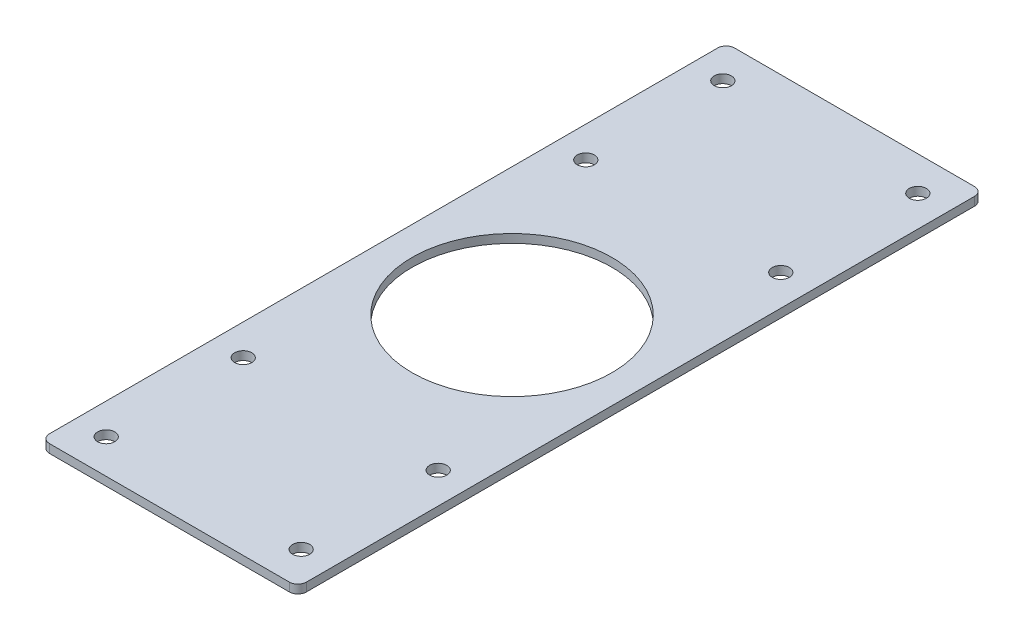
ISO-10303-21;
HEADER;
FILE_DESCRIPTION(('STEP AP214'),'2;1');
FILE_NAME('part.step','',(''),(''),'','','');
FILE_SCHEMA(('AUTOMOTIVE_DESIGN { 1 0 10303 214 1 1 1 1 }'));
ENDSEC;
DATA;
#1=APPLICATION_CONTEXT('core data for automotive mechanical design processes');
#2=APPLICATION_PROTOCOL_DEFINITION('international standard','automotive_design',2000,#1);
#3=PRODUCT_CONTEXT('',#1,'mechanical');
#4=PRODUCT('Part','Part','',(#3));
#5=PRODUCT_RELATED_PRODUCT_CATEGORY('part','',(#4));
#6=PRODUCT_DEFINITION_FORMATION('','',#4);
#7=PRODUCT_DEFINITION_CONTEXT('part definition',#1,'design');
#8=PRODUCT_DEFINITION('design','',#6,#7);
#9=PRODUCT_DEFINITION_SHAPE('','',#8);
#10=(LENGTH_UNIT() NAMED_UNIT(*) SI_UNIT(.MILLI.,.METRE.));
#11=(NAMED_UNIT(*) PLANE_ANGLE_UNIT() SI_UNIT($,.RADIAN.));
#12=(NAMED_UNIT(*) SI_UNIT($,.STERADIAN.) SOLID_ANGLE_UNIT());
#13=UNCERTAINTY_MEASURE_WITH_UNIT(LENGTH_MEASURE(1.E-05),#10,'distance_accuracy_value','');
#14=(GEOMETRIC_REPRESENTATION_CONTEXT(3) GLOBAL_UNCERTAINTY_ASSIGNED_CONTEXT((#13)) GLOBAL_UNIT_ASSIGNED_CONTEXT((#10,
#11,#12)) REPRESENTATION_CONTEXT('',''));
#15=CARTESIAN_POINT('',(0.,0.,0.));
#16=DIRECTION('',(0.,0.,1.));
#17=DIRECTION('',(1.,0.,0.));
#18=AXIS2_PLACEMENT_3D('',#15,#16,#17);
#19=CARTESIAN_POINT('',(0.,3.,0.));
#20=DIRECTION('',(0.,-1.,0.));
#21=DIRECTION('',(0.,0.,-1.));
#22=AXIS2_PLACEMENT_3D('',#19,#20,#21);
#23=PLANE('',#22);
#24=DIRECTION('',(-1.,0.,0.));
#25=VECTOR('',#24,1.);
#26=CARTESIAN_POINT('',(-45.,3.,-120.));
#27=LINE('',#26,#25);
#28=CARTESIAN_POINT('',(42.,3.,-120.));
#29=VERTEX_POINT('',#28);
#30=CARTESIAN_POINT('',(-42.,3.,-120.));
#31=VERTEX_POINT('',#30);
#32=EDGE_CURVE('E169',#29,#31,#27,.T.);
#33=ORIENTED_EDGE('',*,*,#32,.T.);
#34=CARTESIAN_POINT('',(-42.,3.,-117.));
#35=DIRECTION('',(0.,-1.,0.));
#36=DIRECTION('',(0.,0.,-1.));
#37=AXIS2_PLACEMENT_3D('',#34,#35,#36);
#38=CIRCLE('',#37,3.);
#39=CARTESIAN_POINT('',(-45.,3.,-117.));
#40=VERTEX_POINT('',#39);
#41=EDGE_CURVE('E149',#31,#40,#38,.F.);
#42=ORIENTED_EDGE('',*,*,#41,.T.);
#43=DIRECTION('',(0.,0.,1.));
#44=VECTOR('',#43,1.);
#45=CARTESIAN_POINT('',(-45.,3.,120.));
#46=LINE('',#45,#44);
#47=CARTESIAN_POINT('',(-45.,3.,117.));
#48=VERTEX_POINT('',#47);
#49=EDGE_CURVE('E119',#40,#48,#46,.T.);
#50=ORIENTED_EDGE('',*,*,#49,.T.);
#51=CARTESIAN_POINT('',(-42.,3.,117.));
#52=DIRECTION('',(0.,-1.,0.));
#53=DIRECTION('',(0.,0.,-1.));
#54=AXIS2_PLACEMENT_3D('',#51,#52,#53);
#55=CIRCLE('',#54,3.);
#56=CARTESIAN_POINT('',(-42.,3.,120.));
#57=VERTEX_POINT('',#56);
#58=EDGE_CURVE('E55',#48,#57,#55,.F.);
#59=ORIENTED_EDGE('',*,*,#58,.T.);
#60=DIRECTION('',(1.,0.,0.));
#61=VECTOR('',#60,1.);
#62=CARTESIAN_POINT('',(-45.,3.,120.));
#63=LINE('',#62,#61);
#64=CARTESIAN_POINT('',(42.,3.,120.));
#65=VERTEX_POINT('',#64);
#66=EDGE_CURVE('E136',#57,#65,#63,.T.);
#67=ORIENTED_EDGE('',*,*,#66,.T.);
#68=CARTESIAN_POINT('',(42.,3.,117.));
#69=DIRECTION('',(0.,-1.,0.));
#70=DIRECTION('',(0.,0.,-1.));
#71=AXIS2_PLACEMENT_3D('',#68,#69,#70);
#72=CIRCLE('',#71,3.);
#73=CARTESIAN_POINT('',(45.,3.,117.));
#74=VERTEX_POINT('',#73);
#75=EDGE_CURVE('E144',#65,#74,#72,.F.);
#76=ORIENTED_EDGE('',*,*,#75,.T.);
#77=DIRECTION('',(0.,0.,-1.));
#78=VECTOR('',#77,1.);
#79=CARTESIAN_POINT('',(45.,3.,120.));
#80=LINE('',#79,#78);
#81=CARTESIAN_POINT('',(45.,3.,-117.));
#82=VERTEX_POINT('',#81);
#83=EDGE_CURVE('E130',#74,#82,#80,.T.);
#84=ORIENTED_EDGE('',*,*,#83,.T.);
#85=CARTESIAN_POINT('',(42.,3.,-117.));
#86=DIRECTION('',(0.,-1.,0.));
#87=DIRECTION('',(0.,0.,-1.));
#88=AXIS2_PLACEMENT_3D('',#85,#86,#87);
#89=CIRCLE('',#88,3.);
#90=EDGE_CURVE('E147',#82,#29,#89,.F.);
#91=ORIENTED_EDGE('',*,*,#90,.T.);
#92=EDGE_LOOP('',(#33,#42,#50,#59,#67,#76,#84,#91));
#93=FACE_BOUND('',#92,.T.);
#94=CARTESIAN_POINT('',(0.,3.,0.));
#95=DIRECTION('',(0.,1.,0.));
#96=DIRECTION('',(0.,0.,1.));
#97=AXIS2_PLACEMENT_3D('',#94,#95,#96);
#98=CIRCLE('',#97,35.);
#99=CARTESIAN_POINT('',(0.,3.,35.));
#100=VERTEX_POINT('',#99);
#101=EDGE_CURVE('E175',#100,#100,#98,.T.);
#102=ORIENTED_EDGE('',*,*,#101,.F.);
#103=EDGE_LOOP('',(#102));
#104=FACE_BOUND('',#103,.T.);
#105=CARTESIAN_POINT('',(-34.15,3.,-60.));
#106=DIRECTION('',(0.,1.,0.));
#107=DIRECTION('',(0.,0.,1.));
#108=AXIS2_PLACEMENT_3D('',#105,#106,#107);
#109=CIRCLE('',#108,3.);
#110=CARTESIAN_POINT('',(-34.15,3.,-57.));
#111=VERTEX_POINT('',#110);
#112=EDGE_CURVE('E184',#111,#111,#109,.T.);
#113=ORIENTED_EDGE('',*,*,#112,.F.);
#114=EDGE_LOOP('',(#113));
#115=FACE_BOUND('',#114,.T.);
#116=CARTESIAN_POINT('',(34.15,3.,-60.));
#117=DIRECTION('',(0.,1.,0.));
#118=DIRECTION('',(0.,0.,-1.));
#119=AXIS2_PLACEMENT_3D('',#116,#117,#118);
#120=CIRCLE('',#119,3.);
#121=CARTESIAN_POINT('',(34.15,3.,-63.));
#122=VERTEX_POINT('',#121);
#123=EDGE_CURVE('E189',#122,#122,#120,.T.);
#124=ORIENTED_EDGE('',*,*,#123,.F.);
#125=EDGE_LOOP('',(#124));
#126=FACE_BOUND('',#125,.T.);
#127=CARTESIAN_POINT('',(34.15,3.,60.));
#128=DIRECTION('',(0.,1.,0.));
#129=DIRECTION('',(0.,0.,1.));
#130=AXIS2_PLACEMENT_3D('',#127,#128,#129);
#131=CIRCLE('',#130,3.);
#132=CARTESIAN_POINT('',(34.15,3.,63.));
#133=VERTEX_POINT('',#132);
#134=EDGE_CURVE('E195',#133,#133,#131,.T.);
#135=ORIENTED_EDGE('',*,*,#134,.F.);
#136=EDGE_LOOP('',(#135));
#137=FACE_BOUND('',#136,.T.);
#138=CARTESIAN_POINT('',(-34.15,3.,60.));
#139=DIRECTION('',(0.,1.,0.));
#140=DIRECTION('',(0.,0.,-1.));
#141=AXIS2_PLACEMENT_3D('',#138,#139,#140);
#142=CIRCLE('',#141,3.);
#143=CARTESIAN_POINT('',(-34.15,3.,57.));
#144=VERTEX_POINT('',#143);
#145=EDGE_CURVE('E201',#144,#144,#142,.T.);
#146=ORIENTED_EDGE('',*,*,#145,.F.);
#147=EDGE_LOOP('',(#146));
#148=FACE_BOUND('',#147,.T.);
#149=CARTESIAN_POINT('',(-34.1500000000002,3.,-108.));
#150=DIRECTION('',(0.,1.,0.));
#151=DIRECTION('',(0.,0.,1.));
#152=AXIS2_PLACEMENT_3D('',#149,#150,#151);
#153=CIRCLE('',#152,3.);
#154=CARTESIAN_POINT('',(-34.1500000000002,3.,-105.));
#155=VERTEX_POINT('',#154);
#156=EDGE_CURVE('E207',#155,#155,#153,.T.);
#157=ORIENTED_EDGE('',*,*,#156,.F.);
#158=EDGE_LOOP('',(#157));
#159=FACE_BOUND('',#158,.T.);
#160=CARTESIAN_POINT('',(34.1499999999998,3.,-108.));
#161=DIRECTION('',(0.,1.,0.));
#162=DIRECTION('',(0.,0.,-1.));
#163=AXIS2_PLACEMENT_3D('',#160,#161,#162);
#164=CIRCLE('',#163,3.);
#165=CARTESIAN_POINT('',(34.1499999999998,3.,-111.));
#166=VERTEX_POINT('',#165);
#167=EDGE_CURVE('E213',#166,#166,#164,.T.);
#168=ORIENTED_EDGE('',*,*,#167,.F.);
#169=EDGE_LOOP('',(#168));
#170=FACE_BOUND('',#169,.T.);
#171=CARTESIAN_POINT('',(34.1500000000005,3.,108.));
#172=DIRECTION('',(0.,1.,0.));
#173=DIRECTION('',(0.,0.,1.));
#174=AXIS2_PLACEMENT_3D('',#171,#172,#173);
#175=CIRCLE('',#174,3.);
#176=CARTESIAN_POINT('',(34.1500000000005,3.,111.));
#177=VERTEX_POINT('',#176);
#178=EDGE_CURVE('E219',#177,#177,#175,.T.);
#179=ORIENTED_EDGE('',*,*,#178,.F.);
#180=EDGE_LOOP('',(#179));
#181=FACE_BOUND('',#180,.T.);
#182=CARTESIAN_POINT('',(-34.1499999999995,3.,108.));
#183=DIRECTION('',(0.,1.,0.));
#184=DIRECTION('',(0.,0.,-1.));
#185=AXIS2_PLACEMENT_3D('',#182,#183,#184);
#186=CIRCLE('',#185,3.);
#187=CARTESIAN_POINT('',(-34.1499999999995,3.,105.));
#188=VERTEX_POINT('',#187);
#189=EDGE_CURVE('E225',#188,#188,#186,.T.);
#190=ORIENTED_EDGE('',*,*,#189,.F.);
#191=EDGE_LOOP('',(#190));
#192=FACE_BOUND('',#191,.T.);
#193=ADVANCED_FACE('F34',(#93,#104,#115,#126,#137,#148,#159,#170,#181,#192),#23,.F.);
#194=CARTESIAN_POINT('',(0.,0.,0.));
#195=DIRECTION('',(0.,-1.,0.));
#196=DIRECTION('',(0.,0.,-1.));
#197=AXIS2_PLACEMENT_3D('',#194,#195,#196);
#198=PLANE('',#197);
#199=CARTESIAN_POINT('',(34.1500000000005,0.,108.));
#200=DIRECTION('',(0.,1.,0.));
#201=DIRECTION('',(0.,0.,1.));
#202=AXIS2_PLACEMENT_3D('',#199,#200,#201);
#203=CIRCLE('',#202,3.);
#204=CARTESIAN_POINT('',(34.1500000000005,0.,111.));
#205=VERTEX_POINT('',#204);
#206=EDGE_CURVE('E222',#205,#205,#203,.T.);
#207=ORIENTED_EDGE('',*,*,#206,.T.);
#208=EDGE_LOOP('',(#207));
#209=FACE_BOUND('',#208,.T.);
#210=CARTESIAN_POINT('',(-34.1500000000002,0.,-108.));
#211=DIRECTION('',(0.,1.,0.));
#212=DIRECTION('',(0.,0.,1.));
#213=AXIS2_PLACEMENT_3D('',#210,#211,#212);
#214=CIRCLE('',#213,3.);
#215=CARTESIAN_POINT('',(-34.1500000000002,0.,-105.));
#216=VERTEX_POINT('',#215);
#217=EDGE_CURVE('E210',#216,#216,#214,.T.);
#218=ORIENTED_EDGE('',*,*,#217,.T.);
#219=EDGE_LOOP('',(#218));
#220=FACE_BOUND('',#219,.T.);
#221=CARTESIAN_POINT('',(34.15,0.,60.));
#222=DIRECTION('',(0.,1.,0.));
#223=DIRECTION('',(0.,0.,1.));
#224=AXIS2_PLACEMENT_3D('',#221,#222,#223);
#225=CIRCLE('',#224,3.);
#226=CARTESIAN_POINT('',(34.15,0.,63.));
#227=VERTEX_POINT('',#226);
#228=EDGE_CURVE('E198',#227,#227,#225,.T.);
#229=ORIENTED_EDGE('',*,*,#228,.T.);
#230=EDGE_LOOP('',(#229));
#231=FACE_BOUND('',#230,.T.);
#232=CARTESIAN_POINT('',(-34.15,0.,-60.));
#233=DIRECTION('',(0.,1.,0.));
#234=DIRECTION('',(0.,0.,1.));
#235=AXIS2_PLACEMENT_3D('',#232,#233,#234);
#236=CIRCLE('',#235,3.);
#237=CARTESIAN_POINT('',(-34.15,0.,-57.));
#238=VERTEX_POINT('',#237);
#239=EDGE_CURVE('E186',#238,#238,#236,.T.);
#240=ORIENTED_EDGE('',*,*,#239,.T.);
#241=EDGE_LOOP('',(#240));
#242=FACE_BOUND('',#241,.T.);
#243=DIRECTION('',(0.,0.,1.));
#244=VECTOR('',#243,1.);
#245=CARTESIAN_POINT('',(-45.,0.,120.));
#246=LINE('',#245,#244);
#247=CARTESIAN_POINT('',(-45.,0.,-117.));
#248=VERTEX_POINT('',#247);
#249=CARTESIAN_POINT('',(-45.,0.,117.));
#250=VERTEX_POINT('',#249);
#251=EDGE_CURVE('E117',#248,#250,#246,.T.);
#252=ORIENTED_EDGE('',*,*,#251,.F.);
#253=CARTESIAN_POINT('',(-42.,0.,-117.));
#254=DIRECTION('',(0.,-1.,0.));
#255=DIRECTION('',(0.,0.,-1.));
#256=AXIS2_PLACEMENT_3D('',#253,#254,#255);
#257=CIRCLE('',#256,3.);
#258=CARTESIAN_POINT('',(-42.,0.,-120.));
#259=VERTEX_POINT('',#258);
#260=EDGE_CURVE('E100',#248,#259,#257,.T.);
#261=ORIENTED_EDGE('',*,*,#260,.T.);
#262=DIRECTION('',(-1.,0.,0.));
#263=VECTOR('',#262,1.);
#264=CARTESIAN_POINT('',(-45.,0.,-120.));
#265=LINE('',#264,#263);
#266=CARTESIAN_POINT('',(42.,0.,-120.));
#267=VERTEX_POINT('',#266);
#268=EDGE_CURVE('E128',#267,#259,#265,.T.);
#269=ORIENTED_EDGE('',*,*,#268,.F.);
#270=CARTESIAN_POINT('',(42.,0.,-117.));
#271=DIRECTION('',(0.,-1.,0.));
#272=DIRECTION('',(0.,0.,-1.));
#273=AXIS2_PLACEMENT_3D('',#270,#271,#272);
#274=CIRCLE('',#273,3.);
#275=CARTESIAN_POINT('',(45.,0.,-117.));
#276=VERTEX_POINT('',#275);
#277=EDGE_CURVE('E111',#267,#276,#274,.T.);
#278=ORIENTED_EDGE('',*,*,#277,.T.);
#279=DIRECTION('',(0.,0.,-1.));
#280=VECTOR('',#279,1.);
#281=CARTESIAN_POINT('',(45.,0.,120.));
#282=LINE('',#281,#280);
#283=CARTESIAN_POINT('',(45.,0.,117.));
#284=VERTEX_POINT('',#283);
#285=EDGE_CURVE('E132',#284,#276,#282,.T.);
#286=ORIENTED_EDGE('',*,*,#285,.F.);
#287=CARTESIAN_POINT('',(42.,0.,117.));
#288=DIRECTION('',(0.,-1.,0.));
#289=DIRECTION('',(0.,0.,-1.));
#290=AXIS2_PLACEMENT_3D('',#287,#288,#289);
#291=CIRCLE('',#290,3.);
#292=CARTESIAN_POINT('',(42.,0.,120.));
#293=VERTEX_POINT('',#292);
#294=EDGE_CURVE('E120',#284,#293,#291,.T.);
#295=ORIENTED_EDGE('',*,*,#294,.T.);
#296=DIRECTION('',(1.,0.,0.));
#297=VECTOR('',#296,1.);
#298=CARTESIAN_POINT('',(-45.,0.,120.));
#299=LINE('',#298,#297);
#300=CARTESIAN_POINT('',(-42.,0.,120.));
#301=VERTEX_POINT('',#300);
#302=EDGE_CURVE('E127',#301,#293,#299,.T.);
#303=ORIENTED_EDGE('',*,*,#302,.F.);
#304=CARTESIAN_POINT('',(-42.,0.,117.));
#305=DIRECTION('',(0.,-1.,0.));
#306=DIRECTION('',(0.,0.,-1.));
#307=AXIS2_PLACEMENT_3D('',#304,#305,#306);
#308=CIRCLE('',#307,3.);
#309=EDGE_CURVE('E126',#301,#250,#308,.T.);
#310=ORIENTED_EDGE('',*,*,#309,.T.);
#311=EDGE_LOOP('',(#252,#261,#269,#278,#286,#295,#303,#310));
#312=FACE_BOUND('',#311,.T.);
#313=CARTESIAN_POINT('',(0.,0.,0.));
#314=DIRECTION('',(0.,1.,0.));
#315=DIRECTION('',(0.,0.,1.));
#316=AXIS2_PLACEMENT_3D('',#313,#314,#315);
#317=CIRCLE('',#316,35.);
#318=CARTESIAN_POINT('',(0.,0.,35.));
#319=VERTEX_POINT('',#318);
#320=EDGE_CURVE('E177',#319,#319,#317,.T.);
#321=ORIENTED_EDGE('',*,*,#320,.T.);
#322=EDGE_LOOP('',(#321));
#323=FACE_BOUND('',#322,.T.);
#324=CARTESIAN_POINT('',(34.15,0.,-60.));
#325=DIRECTION('',(0.,1.,0.));
#326=DIRECTION('',(0.,0.,-1.));
#327=AXIS2_PLACEMENT_3D('',#324,#325,#326);
#328=CIRCLE('',#327,3.);
#329=CARTESIAN_POINT('',(34.15,0.,-63.));
#330=VERTEX_POINT('',#329);
#331=EDGE_CURVE('E192',#330,#330,#328,.T.);
#332=ORIENTED_EDGE('',*,*,#331,.T.);
#333=EDGE_LOOP('',(#332));
#334=FACE_BOUND('',#333,.T.);
#335=CARTESIAN_POINT('',(-34.15,0.,60.));
#336=DIRECTION('',(0.,1.,0.));
#337=DIRECTION('',(0.,0.,-1.));
#338=AXIS2_PLACEMENT_3D('',#335,#336,#337);
#339=CIRCLE('',#338,3.);
#340=CARTESIAN_POINT('',(-34.15,0.,57.));
#341=VERTEX_POINT('',#340);
#342=EDGE_CURVE('E204',#341,#341,#339,.T.);
#343=ORIENTED_EDGE('',*,*,#342,.T.);
#344=EDGE_LOOP('',(#343));
#345=FACE_BOUND('',#344,.T.);
#346=CARTESIAN_POINT('',(34.1499999999998,0.,-108.));
#347=DIRECTION('',(0.,1.,0.));
#348=DIRECTION('',(0.,0.,-1.));
#349=AXIS2_PLACEMENT_3D('',#346,#347,#348);
#350=CIRCLE('',#349,3.);
#351=CARTESIAN_POINT('',(34.1499999999998,0.,-111.));
#352=VERTEX_POINT('',#351);
#353=EDGE_CURVE('E216',#352,#352,#350,.T.);
#354=ORIENTED_EDGE('',*,*,#353,.T.);
#355=EDGE_LOOP('',(#354));
#356=FACE_BOUND('',#355,.T.);
#357=CARTESIAN_POINT('',(-34.1499999999995,0.,108.));
#358=DIRECTION('',(0.,1.,0.));
#359=DIRECTION('',(0.,0.,-1.));
#360=AXIS2_PLACEMENT_3D('',#357,#358,#359);
#361=CIRCLE('',#360,3.);
#362=CARTESIAN_POINT('',(-34.1499999999995,0.,105.));
#363=VERTEX_POINT('',#362);
#364=EDGE_CURVE('E228',#363,#363,#361,.T.);
#365=ORIENTED_EDGE('',*,*,#364,.T.);
#366=EDGE_LOOP('',(#365));
#367=FACE_BOUND('',#366,.T.);
#368=ADVANCED_FACE('F123',(#209,#220,#231,#242,#312,#323,#334,#345,#356,#367),#198,.T.);
#369=CARTESIAN_POINT('',(45.,3.,120.));
#370=DIRECTION('',(-1.,0.,0.));
#371=DIRECTION('',(0.,0.,1.));
#372=AXIS2_PLACEMENT_3D('',#369,#370,#371);
#373=PLANE('',#372);
#374=ORIENTED_EDGE('',*,*,#285,.T.);
#375=DIRECTION('',(0.,-1.,0.));
#376=VECTOR('',#375,1.);
#377=CARTESIAN_POINT('',(45.,3.,-117.));
#378=LINE('',#377,#376);
#379=EDGE_CURVE('E154',#276,#82,#378,.F.);
#380=ORIENTED_EDGE('',*,*,#379,.T.);
#381=ORIENTED_EDGE('',*,*,#83,.F.);
#382=DIRECTION('',(0.,-1.,0.));
#383=VECTOR('',#382,1.);
#384=CARTESIAN_POINT('',(45.,3.,117.));
#385=LINE('',#384,#383);
#386=EDGE_CURVE('E151',#74,#284,#385,.T.);
#387=ORIENTED_EDGE('',*,*,#386,.T.);
#388=EDGE_LOOP('',(#374,#380,#381,#387));
#389=FACE_BOUND('',#388,.T.);
#390=ADVANCED_FACE('F160',(#389),#373,.F.);
#391=CARTESIAN_POINT('',(-45.,3.,-120.));
#392=DIRECTION('',(0.,0.,1.));
#393=DIRECTION('',(1.,0.,0.));
#394=AXIS2_PLACEMENT_3D('',#391,#392,#393);
#395=PLANE('',#394);
#396=ORIENTED_EDGE('',*,*,#268,.T.);
#397=DIRECTION('',(0.,-1.,0.));
#398=VECTOR('',#397,1.);
#399=CARTESIAN_POINT('',(-42.,3.,-120.));
#400=LINE('',#399,#398);
#401=EDGE_CURVE('E105',#259,#31,#400,.F.);
#402=ORIENTED_EDGE('',*,*,#401,.T.);
#403=ORIENTED_EDGE('',*,*,#32,.F.);
#404=DIRECTION('',(0.,-1.,0.));
#405=VECTOR('',#404,1.);
#406=CARTESIAN_POINT('',(42.,3.,-120.));
#407=LINE('',#406,#405);
#408=EDGE_CURVE('E110',#29,#267,#407,.T.);
#409=ORIENTED_EDGE('',*,*,#408,.T.);
#410=EDGE_LOOP('',(#396,#402,#403,#409));
#411=FACE_BOUND('',#410,.T.);
#412=ADVANCED_FACE('F174',(#411),#395,.F.);
#413=CARTESIAN_POINT('',(-45.,3.,120.));
#414=DIRECTION('',(1.,0.,0.));
#415=DIRECTION('',(0.,0.,-1.));
#416=AXIS2_PLACEMENT_3D('',#413,#414,#415);
#417=PLANE('',#416);
#418=ORIENTED_EDGE('',*,*,#49,.F.);
#419=DIRECTION('',(0.,-1.,0.));
#420=VECTOR('',#419,1.);
#421=CARTESIAN_POINT('',(-45.,3.,-117.));
#422=LINE('',#421,#420);
#423=EDGE_CURVE('E104',#40,#248,#422,.T.);
#424=ORIENTED_EDGE('',*,*,#423,.T.);
#425=ORIENTED_EDGE('',*,*,#251,.T.);
#426=DIRECTION('',(0.,-1.,0.));
#427=VECTOR('',#426,1.);
#428=CARTESIAN_POINT('',(-45.,3.,117.));
#429=LINE('',#428,#427);
#430=EDGE_CURVE('E121',#250,#48,#429,.F.);
#431=ORIENTED_EDGE('',*,*,#430,.T.);
#432=EDGE_LOOP('',(#418,#424,#425,#431));
#433=FACE_BOUND('',#432,.T.);
#434=ADVANCED_FACE('F116',(#433),#417,.F.);
#435=CARTESIAN_POINT('',(-45.,3.,120.));
#436=DIRECTION('',(0.,0.,-1.));
#437=DIRECTION('',(-1.,0.,0.));
#438=AXIS2_PLACEMENT_3D('',#435,#436,#437);
#439=PLANE('',#438);
#440=ORIENTED_EDGE('',*,*,#66,.F.);
#441=DIRECTION('',(0.,-1.,0.));
#442=VECTOR('',#441,1.);
#443=CARTESIAN_POINT('',(-42.,3.,120.));
#444=LINE('',#443,#442);
#445=EDGE_CURVE('E11',#57,#301,#444,.T.);
#446=ORIENTED_EDGE('',*,*,#445,.T.);
#447=ORIENTED_EDGE('',*,*,#302,.T.);
#448=DIRECTION('',(0.,-1.,0.));
#449=VECTOR('',#448,1.);
#450=CARTESIAN_POINT('',(42.,3.,120.));
#451=LINE('',#450,#449);
#452=EDGE_CURVE('E42',#293,#65,#451,.F.);
#453=ORIENTED_EDGE('',*,*,#452,.T.);
#454=EDGE_LOOP('',(#440,#446,#447,#453));
#455=FACE_BOUND('',#454,.T.);
#456=ADVANCED_FACE('F248',(#455),#439,.F.);
#457=CARTESIAN_POINT('',(0.,3.,0.));
#458=DIRECTION('',(0.,-1.,0.));
#459=DIRECTION('',(0.,0.,-1.));
#460=AXIS2_PLACEMENT_3D('',#457,#458,#459);
#461=CYLINDRICAL_SURFACE('',#460,35.);
#462=ORIENTED_EDGE('',*,*,#101,.T.);
#463=EDGE_LOOP('',(#462));
#464=FACE_BOUND('',#463,.T.);
#465=ORIENTED_EDGE('',*,*,#320,.F.);
#466=EDGE_LOOP('',(#465));
#467=FACE_BOUND('',#466,.T.);
#468=ADVANCED_FACE('F245',(#464,#467),#461,.F.);
#469=CARTESIAN_POINT('',(-34.15,3.,-60.));
#470=DIRECTION('',(0.,-1.,0.));
#471=DIRECTION('',(0.,0.,-1.));
#472=AXIS2_PLACEMENT_3D('',#469,#470,#471);
#473=CYLINDRICAL_SURFACE('',#472,3.);
#474=ORIENTED_EDGE('',*,*,#112,.T.);
#475=EDGE_LOOP('',(#474));
#476=FACE_BOUND('',#475,.T.);
#477=ORIENTED_EDGE('',*,*,#239,.F.);
#478=EDGE_LOOP('',(#477));
#479=FACE_BOUND('',#478,.T.);
#480=ADVANCED_FACE('F390',(#476,#479),#473,.F.);
#481=CARTESIAN_POINT('',(34.15,3.,-60.));
#482=DIRECTION('',(0.,-1.,0.));
#483=DIRECTION('',(0.,0.,-1.));
#484=AXIS2_PLACEMENT_3D('',#481,#482,#483);
#485=CYLINDRICAL_SURFACE('',#484,3.);
#486=ORIENTED_EDGE('',*,*,#123,.T.);
#487=EDGE_LOOP('',(#486));
#488=FACE_BOUND('',#487,.T.);
#489=ORIENTED_EDGE('',*,*,#331,.F.);
#490=EDGE_LOOP('',(#489));
#491=FACE_BOUND('',#490,.T.);
#492=ADVANCED_FACE('F380',(#488,#491),#485,.F.);
#493=CARTESIAN_POINT('',(34.15,3.,60.));
#494=DIRECTION('',(0.,-1.,0.));
#495=DIRECTION('',(0.,0.,-1.));
#496=AXIS2_PLACEMENT_3D('',#493,#494,#495);
#497=CYLINDRICAL_SURFACE('',#496,3.);
#498=ORIENTED_EDGE('',*,*,#134,.T.);
#499=EDGE_LOOP('',(#498));
#500=FACE_BOUND('',#499,.T.);
#501=ORIENTED_EDGE('',*,*,#228,.F.);
#502=EDGE_LOOP('',(#501));
#503=FACE_BOUND('',#502,.T.);
#504=ADVANCED_FACE('F370',(#500,#503),#497,.F.);
#505=CARTESIAN_POINT('',(-34.15,3.,60.));
#506=DIRECTION('',(0.,-1.,0.));
#507=DIRECTION('',(0.,0.,-1.));
#508=AXIS2_PLACEMENT_3D('',#505,#506,#507);
#509=CYLINDRICAL_SURFACE('',#508,3.);
#510=ORIENTED_EDGE('',*,*,#145,.T.);
#511=EDGE_LOOP('',(#510));
#512=FACE_BOUND('',#511,.T.);
#513=ORIENTED_EDGE('',*,*,#342,.F.);
#514=EDGE_LOOP('',(#513));
#515=FACE_BOUND('',#514,.T.);
#516=ADVANCED_FACE('F360',(#512,#515),#509,.F.);
#517=CARTESIAN_POINT('',(-34.1500000000002,3.,-108.));
#518=DIRECTION('',(0.,-1.,0.));
#519=DIRECTION('',(0.,0.,-1.));
#520=AXIS2_PLACEMENT_3D('',#517,#518,#519);
#521=CYLINDRICAL_SURFACE('',#520,3.);
#522=ORIENTED_EDGE('',*,*,#156,.T.);
#523=EDGE_LOOP('',(#522));
#524=FACE_BOUND('',#523,.T.);
#525=ORIENTED_EDGE('',*,*,#217,.F.);
#526=EDGE_LOOP('',(#525));
#527=FACE_BOUND('',#526,.T.);
#528=ADVANCED_FACE('F350',(#524,#527),#521,.F.);
#529=CARTESIAN_POINT('',(34.1499999999998,3.,-108.));
#530=DIRECTION('',(0.,-1.,0.));
#531=DIRECTION('',(0.,0.,-1.));
#532=AXIS2_PLACEMENT_3D('',#529,#530,#531);
#533=CYLINDRICAL_SURFACE('',#532,3.);
#534=ORIENTED_EDGE('',*,*,#167,.T.);
#535=EDGE_LOOP('',(#534));
#536=FACE_BOUND('',#535,.T.);
#537=ORIENTED_EDGE('',*,*,#353,.F.);
#538=EDGE_LOOP('',(#537));
#539=FACE_BOUND('',#538,.T.);
#540=ADVANCED_FACE('F340',(#536,#539),#533,.F.);
#541=CARTESIAN_POINT('',(34.1500000000005,3.,108.));
#542=DIRECTION('',(0.,-1.,0.));
#543=DIRECTION('',(0.,0.,-1.));
#544=AXIS2_PLACEMENT_3D('',#541,#542,#543);
#545=CYLINDRICAL_SURFACE('',#544,3.);
#546=ORIENTED_EDGE('',*,*,#178,.T.);
#547=EDGE_LOOP('',(#546));
#548=FACE_BOUND('',#547,.T.);
#549=ORIENTED_EDGE('',*,*,#206,.F.);
#550=EDGE_LOOP('',(#549));
#551=FACE_BOUND('',#550,.T.);
#552=ADVANCED_FACE('F331',(#548,#551),#545,.F.);
#553=CARTESIAN_POINT('',(-34.1499999999995,3.,108.));
#554=DIRECTION('',(0.,-1.,0.));
#555=DIRECTION('',(0.,0.,-1.));
#556=AXIS2_PLACEMENT_3D('',#553,#554,#555);
#557=CYLINDRICAL_SURFACE('',#556,3.);
#558=ORIENTED_EDGE('',*,*,#189,.T.);
#559=EDGE_LOOP('',(#558));
#560=FACE_BOUND('',#559,.T.);
#561=ORIENTED_EDGE('',*,*,#364,.F.);
#562=EDGE_LOOP('',(#561));
#563=FACE_BOUND('',#562,.T.);
#564=ADVANCED_FACE('F234',(#560,#563),#557,.F.);
#565=CARTESIAN_POINT('',(-42.,3.,-117.));
#566=DIRECTION('',(0.,-1.,0.));
#567=DIRECTION('',(0.,0.,-1.));
#568=AXIS2_PLACEMENT_3D('',#565,#566,#567);
#569=CYLINDRICAL_SURFACE('',#568,3.);
#570=ORIENTED_EDGE('',*,*,#41,.F.);
#571=ORIENTED_EDGE('',*,*,#401,.F.);
#572=ORIENTED_EDGE('',*,*,#260,.F.);
#573=ORIENTED_EDGE('',*,*,#423,.F.);
#574=EDGE_LOOP('',(#570,#571,#572,#573));
#575=FACE_BOUND('',#574,.T.);
#576=ADVANCED_FACE('F103',(#575),#569,.T.);
#577=CARTESIAN_POINT('',(42.,3.,-117.));
#578=DIRECTION('',(0.,-1.,0.));
#579=DIRECTION('',(0.,0.,-1.));
#580=AXIS2_PLACEMENT_3D('',#577,#578,#579);
#581=CYLINDRICAL_SURFACE('',#580,3.);
#582=ORIENTED_EDGE('',*,*,#90,.F.);
#583=ORIENTED_EDGE('',*,*,#379,.F.);
#584=ORIENTED_EDGE('',*,*,#277,.F.);
#585=ORIENTED_EDGE('',*,*,#408,.F.);
#586=EDGE_LOOP('',(#582,#583,#584,#585));
#587=FACE_BOUND('',#586,.T.);
#588=ADVANCED_FACE('F172',(#587),#581,.T.);
#589=CARTESIAN_POINT('',(-42.,3.,117.));
#590=DIRECTION('',(0.,-1.,0.));
#591=DIRECTION('',(0.,0.,-1.));
#592=AXIS2_PLACEMENT_3D('',#589,#590,#591);
#593=CYLINDRICAL_SURFACE('',#592,3.);
#594=ORIENTED_EDGE('',*,*,#58,.F.);
#595=ORIENTED_EDGE('',*,*,#430,.F.);
#596=ORIENTED_EDGE('',*,*,#309,.F.);
#597=ORIENTED_EDGE('',*,*,#445,.F.);
#598=EDGE_LOOP('',(#594,#595,#596,#597));
#599=FACE_BOUND('',#598,.T.);
#600=ADVANCED_FACE('F260',(#599),#593,.T.);
#601=CARTESIAN_POINT('',(42.,3.,117.));
#602=DIRECTION('',(0.,-1.,0.));
#603=DIRECTION('',(0.,0.,-1.));
#604=AXIS2_PLACEMENT_3D('',#601,#602,#603);
#605=CYLINDRICAL_SURFACE('',#604,3.);
#606=ORIENTED_EDGE('',*,*,#75,.F.);
#607=ORIENTED_EDGE('',*,*,#452,.F.);
#608=ORIENTED_EDGE('',*,*,#294,.F.);
#609=ORIENTED_EDGE('',*,*,#386,.F.);
#610=EDGE_LOOP('',(#606,#607,#608,#609));
#611=FACE_BOUND('',#610,.T.);
#612=ADVANCED_FACE('F36',(#611),#605,.T.);
#613=CLOSED_SHELL('',(#193,#368,#390,#412,#434,#456,#468,#480,#492,#504,#516,#528,#540,#552,
#564,#576,#588,#600,#612));
#614=MANIFOLD_SOLID_BREP('B2',#613);
#615=ADVANCED_BREP_SHAPE_REPRESENTATION('',(#18,#614),#14);
#616=SHAPE_DEFINITION_REPRESENTATION(#9,#615);
ENDSEC;
END-ISO-10303-21;
